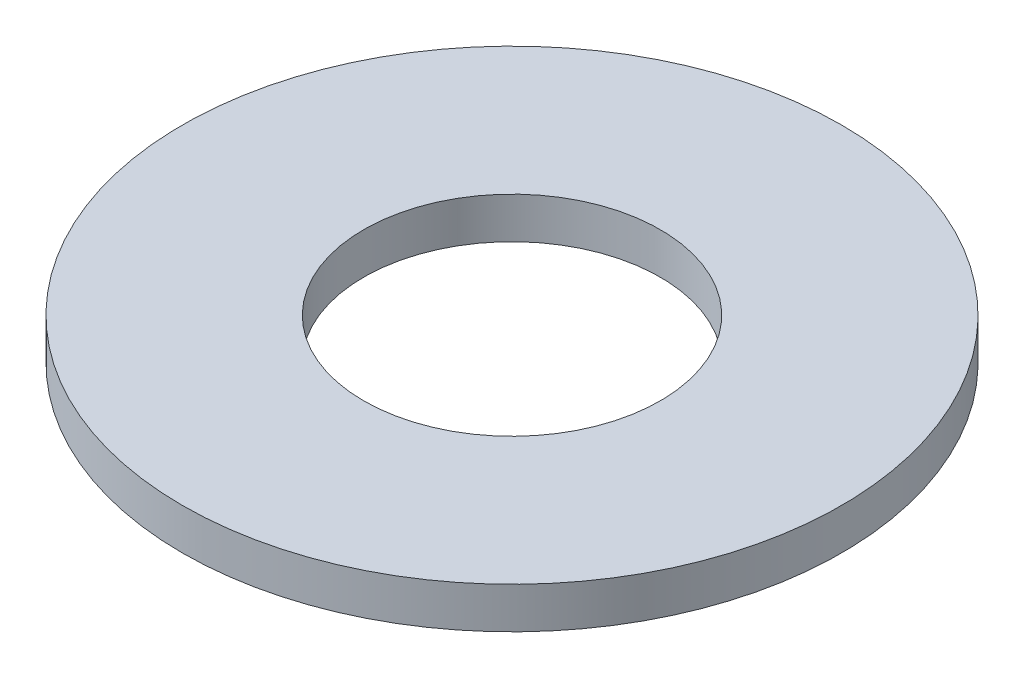
ISO-10303-21;
HEADER;
FILE_DESCRIPTION(('STEP AP214'),'2;1');
FILE_NAME('part.step','',(''),(''),'','','');
FILE_SCHEMA(('AUTOMOTIVE_DESIGN { 1 0 10303 214 1 1 1 1 }'));
ENDSEC;
DATA;
#1=APPLICATION_CONTEXT('core data for automotive mechanical design processes');
#2=APPLICATION_PROTOCOL_DEFINITION('international standard','automotive_design',2000,#1);
#3=PRODUCT_CONTEXT('',#1,'mechanical');
#4=PRODUCT('Part','Part','',(#3));
#5=PRODUCT_RELATED_PRODUCT_CATEGORY('part','',(#4));
#6=PRODUCT_DEFINITION_FORMATION('','',#4);
#7=PRODUCT_DEFINITION_CONTEXT('part definition',#1,'design');
#8=PRODUCT_DEFINITION('design','',#6,#7);
#9=PRODUCT_DEFINITION_SHAPE('','',#8);
#10=(LENGTH_UNIT() NAMED_UNIT(*) SI_UNIT(.MILLI.,.METRE.));
#11=(NAMED_UNIT(*) PLANE_ANGLE_UNIT() SI_UNIT($,.RADIAN.));
#12=(NAMED_UNIT(*) SI_UNIT($,.STERADIAN.) SOLID_ANGLE_UNIT());
#13=UNCERTAINTY_MEASURE_WITH_UNIT(LENGTH_MEASURE(1.E-05),#10,'distance_accuracy_value','');
#14=(GEOMETRIC_REPRESENTATION_CONTEXT(3) GLOBAL_UNCERTAINTY_ASSIGNED_CONTEXT((#13)) GLOBAL_UNIT_ASSIGNED_CONTEXT((#10,
#11,#12)) REPRESENTATION_CONTEXT('',''));
#15=CARTESIAN_POINT('',(0.,0.,0.));
#16=DIRECTION('',(0.,0.,1.));
#17=DIRECTION('',(1.,0.,0.));
#18=AXIS2_PLACEMENT_3D('',#15,#16,#17);
#19=CARTESIAN_POINT('',(0.,0.5,0.));
#20=DIRECTION('',(0.,1.,0.));
#21=DIRECTION('',(0.,0.,1.));
#22=AXIS2_PLACEMENT_3D('',#19,#20,#21);
#23=PLANE('',#22);
#24=CARTESIAN_POINT('',(0.,0.5,0.));
#25=DIRECTION('',(0.,1.,0.));
#26=DIRECTION('',(0.,0.,1.));
#27=AXIS2_PLACEMENT_3D('',#24,#25,#26);
#28=CIRCLE('',#27,4.);
#29=CARTESIAN_POINT('',(0.,0.5,4.));
#30=VERTEX_POINT('',#29);
#31=EDGE_CURVE('E10',#30,#30,#28,.T.);
#32=ORIENTED_EDGE('',*,*,#31,.T.);
#33=EDGE_LOOP('',(#32));
#34=FACE_BOUND('',#33,.T.);
#35=CARTESIAN_POINT('',(0.,0.5,0.));
#36=DIRECTION('',(0.,1.,0.));
#37=DIRECTION('',(0.,0.,1.));
#38=AXIS2_PLACEMENT_3D('',#35,#36,#37);
#39=CIRCLE('',#38,1.8);
#40=CARTESIAN_POINT('',(0.,0.5,1.8));
#41=VERTEX_POINT('',#40);
#42=EDGE_CURVE('E42',#41,#41,#39,.T.);
#43=ORIENTED_EDGE('',*,*,#42,.F.);
#44=EDGE_LOOP('',(#43));
#45=FACE_BOUND('',#44,.T.);
#46=ADVANCED_FACE('F31',(#34,#45),#23,.T.);
#47=CARTESIAN_POINT('',(0.,0.,0.));
#48=DIRECTION('',(0.,1.,0.));
#49=DIRECTION('',(0.,0.,1.));
#50=AXIS2_PLACEMENT_3D('',#47,#48,#49);
#51=PLANE('',#50);
#52=CARTESIAN_POINT('',(0.,0.,0.));
#53=DIRECTION('',(0.,1.,0.));
#54=DIRECTION('',(0.,0.,1.));
#55=AXIS2_PLACEMENT_3D('',#52,#53,#54);
#56=CIRCLE('',#55,4.);
#57=CARTESIAN_POINT('',(0.,0.,4.));
#58=VERTEX_POINT('',#57);
#59=EDGE_CURVE('E35',#58,#58,#56,.T.);
#60=ORIENTED_EDGE('',*,*,#59,.F.);
#61=EDGE_LOOP('',(#60));
#62=FACE_BOUND('',#61,.T.);
#63=CARTESIAN_POINT('',(0.,0.,0.));
#64=DIRECTION('',(0.,1.,0.));
#65=DIRECTION('',(0.,0.,1.));
#66=AXIS2_PLACEMENT_3D('',#63,#64,#65);
#67=CIRCLE('',#66,1.8);
#68=CARTESIAN_POINT('',(0.,0.,1.8));
#69=VERTEX_POINT('',#68);
#70=EDGE_CURVE('E44',#69,#69,#67,.T.);
#71=ORIENTED_EDGE('',*,*,#70,.T.);
#72=EDGE_LOOP('',(#71));
#73=FACE_BOUND('',#72,.T.);
#74=ADVANCED_FACE('F54',(#62,#73),#51,.F.);
#75=CARTESIAN_POINT('',(0.,0.5,0.));
#76=DIRECTION('',(0.,-1.,0.));
#77=DIRECTION('',(0.,0.,-1.));
#78=AXIS2_PLACEMENT_3D('',#75,#76,#77);
#79=CYLINDRICAL_SURFACE('',#78,4.);
#80=ORIENTED_EDGE('',*,*,#31,.F.);
#81=EDGE_LOOP('',(#80));
#82=FACE_BOUND('',#81,.T.);
#83=ORIENTED_EDGE('',*,*,#59,.T.);
#84=EDGE_LOOP('',(#83));
#85=FACE_BOUND('',#84,.T.);
#86=ADVANCED_FACE('F33',(#82,#85),#79,.T.);
#87=CARTESIAN_POINT('',(0.,0.5,0.));
#88=DIRECTION('',(0.,-1.,0.));
#89=DIRECTION('',(0.,0.,-1.));
#90=AXIS2_PLACEMENT_3D('',#87,#88,#89);
#91=CYLINDRICAL_SURFACE('',#90,1.8);
#92=ORIENTED_EDGE('',*,*,#42,.T.);
#93=EDGE_LOOP('',(#92));
#94=FACE_BOUND('',#93,.T.);
#95=ORIENTED_EDGE('',*,*,#70,.F.);
#96=EDGE_LOOP('',(#95));
#97=FACE_BOUND('',#96,.T.);
#98=ADVANCED_FACE('F50',(#94,#97),#91,.F.);
#99=CLOSED_SHELL('',(#46,#74,#86,#98));
#100=MANIFOLD_SOLID_BREP('B2',#99);
#101=ADVANCED_BREP_SHAPE_REPRESENTATION('',(#18,#100),#14);
#102=SHAPE_DEFINITION_REPRESENTATION(#9,#101);
ENDSEC;
END-ISO-10303-21;
